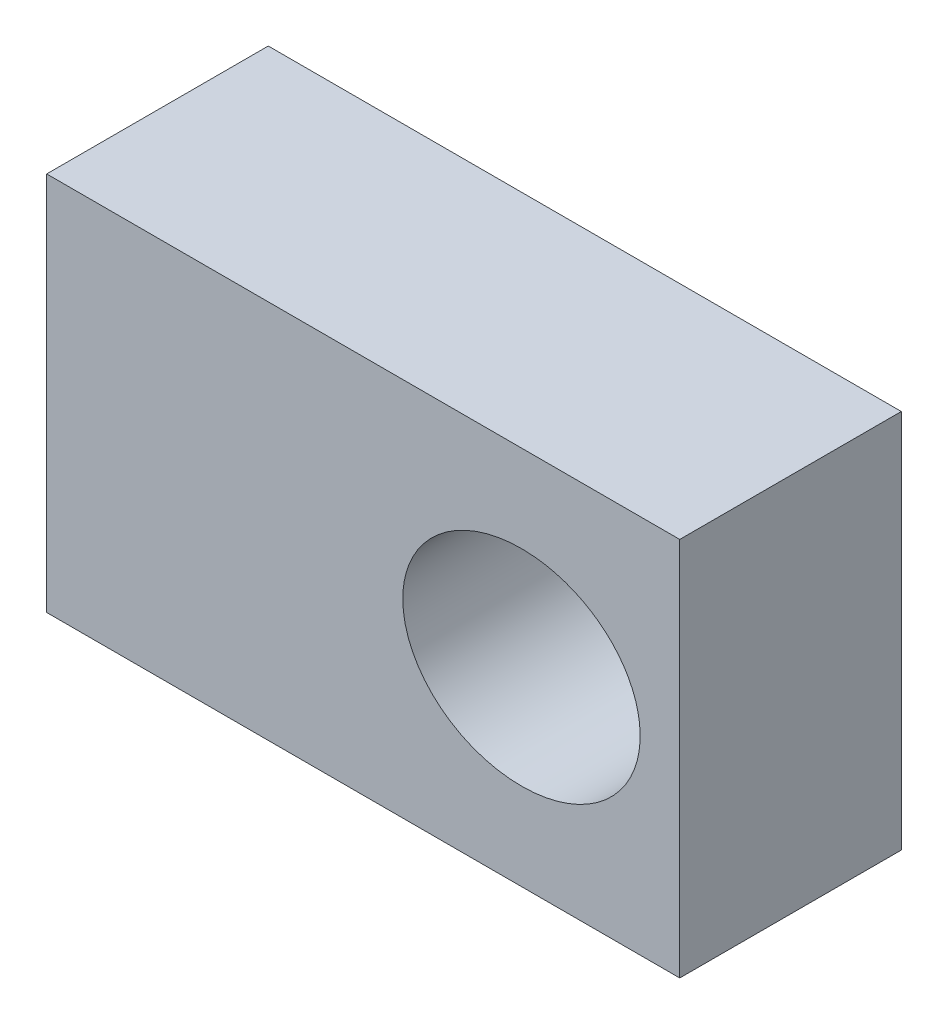
ISO-10303-21;
HEADER;
FILE_DESCRIPTION(('STEP AP214'),'2;1');
FILE_NAME('part.step','',(''),(''),'','','');
FILE_SCHEMA(('AUTOMOTIVE_DESIGN { 1 0 10303 214 1 1 1 1 }'));
ENDSEC;
DATA;
#1=APPLICATION_CONTEXT('core data for automotive mechanical design processes');
#2=APPLICATION_PROTOCOL_DEFINITION('international standard','automotive_design',2000,#1);
#3=PRODUCT_CONTEXT('',#1,'mechanical');
#4=PRODUCT('Part','Part','',(#3));
#5=PRODUCT_RELATED_PRODUCT_CATEGORY('part','',(#4));
#6=PRODUCT_DEFINITION_FORMATION('','',#4);
#7=PRODUCT_DEFINITION_CONTEXT('part definition',#1,'design');
#8=PRODUCT_DEFINITION('design','',#6,#7);
#9=PRODUCT_DEFINITION_SHAPE('','',#8);
#10=(LENGTH_UNIT() NAMED_UNIT(*) SI_UNIT(.MILLI.,.METRE.));
#11=(NAMED_UNIT(*) PLANE_ANGLE_UNIT() SI_UNIT($,.RADIAN.));
#12=(NAMED_UNIT(*) SI_UNIT($,.STERADIAN.) SOLID_ANGLE_UNIT());
#13=UNCERTAINTY_MEASURE_WITH_UNIT(LENGTH_MEASURE(1.E-05),#10,'distance_accuracy_value','');
#14=(GEOMETRIC_REPRESENTATION_CONTEXT(3) GLOBAL_UNCERTAINTY_ASSIGNED_CONTEXT((#13)) GLOBAL_UNIT_ASSIGNED_CONTEXT((#10,
#11,#12)) REPRESENTATION_CONTEXT('',''));
#15=CARTESIAN_POINT('',(0.,0.,0.));
#16=DIRECTION('',(0.,0.,1.));
#17=DIRECTION('',(1.,0.,0.));
#18=AXIS2_PLACEMENT_3D('',#15,#16,#17);
#19=CARTESIAN_POINT('',(0.,0.,70.));
#20=DIRECTION('',(0.,0.,1.));
#21=DIRECTION('',(1.,0.,0.));
#22=AXIS2_PLACEMENT_3D('',#19,#20,#21);
#23=PLANE('',#22);
#24=DIRECTION('',(0.,-1.,0.));
#25=VECTOR('',#24,1.);
#26=CARTESIAN_POINT('',(-150.,60.,70.));
#27=LINE('',#26,#25);
#28=CARTESIAN_POINT('',(-150.,60.,70.));
#29=VERTEX_POINT('',#28);
#30=CARTESIAN_POINT('',(-150.,-60.,70.));
#31=VERTEX_POINT('',#30);
#32=EDGE_CURVE('E92',#29,#31,#27,.T.);
#33=ORIENTED_EDGE('',*,*,#32,.T.);
#34=DIRECTION('',(1.,0.,0.));
#35=VECTOR('',#34,1.);
#36=CARTESIAN_POINT('',(-150.,-60.,70.));
#37=LINE('',#36,#35);
#38=CARTESIAN_POINT('',(50.,-60.,70.));
#39=VERTEX_POINT('',#38);
#40=EDGE_CURVE('E87',#31,#39,#37,.T.);
#41=ORIENTED_EDGE('',*,*,#40,.T.);
#42=DIRECTION('',(0.,1.,0.));
#43=VECTOR('',#42,1.);
#44=CARTESIAN_POINT('',(50.,60.,70.));
#45=LINE('',#44,#43);
#46=CARTESIAN_POINT('',(50.,60.,70.));
#47=VERTEX_POINT('',#46);
#48=EDGE_CURVE('E90',#39,#47,#45,.T.);
#49=ORIENTED_EDGE('',*,*,#48,.T.);
#50=DIRECTION('',(-1.,0.,0.));
#51=VECTOR('',#50,1.);
#52=CARTESIAN_POINT('',(-150.,60.,70.));
#53=LINE('',#52,#51);
#54=EDGE_CURVE('E57',#47,#29,#53,.T.);
#55=ORIENTED_EDGE('',*,*,#54,.T.);
#56=EDGE_LOOP('',(#33,#41,#49,#55));
#57=FACE_BOUND('',#56,.T.);
#58=CARTESIAN_POINT('',(0.,0.,70.));
#59=DIRECTION('',(0.,0.,1.));
#60=DIRECTION('',(-1.,0.,0.));
#61=AXIS2_PLACEMENT_3D('',#58,#59,#60);
#62=ELLIPSE('',#61,37.5,32.5);
#63=CARTESIAN_POINT('',(-37.5,0.,70.));
#64=VERTEX_POINT('',#63);
#65=EDGE_CURVE('E107',#64,#64,#62,.T.);
#66=ORIENTED_EDGE('',*,*,#65,.F.);
#67=EDGE_LOOP('',(#66));
#68=FACE_BOUND('',#67,.T.);
#69=ADVANCED_FACE('F40',(#57,#68),#23,.T.);
#70=CARTESIAN_POINT('',(0.,0.,0.));
#71=DIRECTION('',(0.,0.,1.));
#72=DIRECTION('',(1.,0.,0.));
#73=AXIS2_PLACEMENT_3D('',#70,#71,#72);
#74=PLANE('',#73);
#75=DIRECTION('',(0.,-1.,0.));
#76=VECTOR('',#75,1.);
#77=CARTESIAN_POINT('',(-150.,60.,0.));
#78=LINE('',#77,#76);
#79=CARTESIAN_POINT('',(-150.,60.,0.));
#80=VERTEX_POINT('',#79);
#81=CARTESIAN_POINT('',(-150.,-60.,0.));
#82=VERTEX_POINT('',#81);
#83=EDGE_CURVE('E104',#80,#82,#78,.T.);
#84=ORIENTED_EDGE('',*,*,#83,.F.);
#85=DIRECTION('',(-1.,0.,0.));
#86=VECTOR('',#85,1.);
#87=CARTESIAN_POINT('',(-150.,60.,0.));
#88=LINE('',#87,#86);
#89=CARTESIAN_POINT('',(50.,60.,0.));
#90=VERTEX_POINT('',#89);
#91=EDGE_CURVE('E80',#90,#80,#88,.T.);
#92=ORIENTED_EDGE('',*,*,#91,.F.);
#93=DIRECTION('',(0.,1.,0.));
#94=VECTOR('',#93,1.);
#95=CARTESIAN_POINT('',(50.,60.,0.));
#96=LINE('',#95,#94);
#97=CARTESIAN_POINT('',(50.,-60.,0.));
#98=VERTEX_POINT('',#97);
#99=EDGE_CURVE('E74',#98,#90,#96,.T.);
#100=ORIENTED_EDGE('',*,*,#99,.F.);
#101=DIRECTION('',(1.,0.,0.));
#102=VECTOR('',#101,1.);
#103=CARTESIAN_POINT('',(-150.,-60.,0.));
#104=LINE('',#103,#102);
#105=EDGE_CURVE('E96',#82,#98,#104,.T.);
#106=ORIENTED_EDGE('',*,*,#105,.F.);
#107=EDGE_LOOP('',(#84,#92,#100,#106));
#108=FACE_BOUND('',#107,.T.);
#109=CARTESIAN_POINT('',(0.,0.,0.));
#110=DIRECTION('',(0.,0.,1.));
#111=DIRECTION('',(-1.,0.,0.));
#112=AXIS2_PLACEMENT_3D('',#109,#110,#111);
#113=ELLIPSE('',#112,37.5,32.5);
#114=CARTESIAN_POINT('',(-37.5,0.,0.));
#115=VERTEX_POINT('',#114);
#116=EDGE_CURVE('E119',#115,#115,#113,.T.);
#117=ORIENTED_EDGE('',*,*,#116,.T.);
#118=EDGE_LOOP('',(#117));
#119=FACE_BOUND('',#118,.T.);
#120=ADVANCED_FACE('F115',(#108,#119),#74,.F.);
#121=CARTESIAN_POINT('',(-150.,60.,70.));
#122=DIRECTION('',(1.,0.,0.));
#123=DIRECTION('',(0.,0.,-1.));
#124=AXIS2_PLACEMENT_3D('',#121,#122,#123);
#125=PLANE('',#124);
#126=ORIENTED_EDGE('',*,*,#83,.T.);
#127=DIRECTION('',(0.,0.,-1.));
#128=VECTOR('',#127,1.);
#129=CARTESIAN_POINT('',(-150.,-60.,70.));
#130=LINE('',#129,#128);
#131=EDGE_CURVE('E11',#31,#82,#130,.T.);
#132=ORIENTED_EDGE('',*,*,#131,.F.);
#133=ORIENTED_EDGE('',*,*,#32,.F.);
#134=DIRECTION('',(0.,0.,-1.));
#135=VECTOR('',#134,1.);
#136=CARTESIAN_POINT('',(-150.,60.,70.));
#137=LINE('',#136,#135);
#138=EDGE_CURVE('E100',#29,#80,#137,.T.);
#139=ORIENTED_EDGE('',*,*,#138,.T.);
#140=EDGE_LOOP('',(#126,#132,#133,#139));
#141=FACE_BOUND('',#140,.T.);
#142=ADVANCED_FACE('F42',(#141),#125,.F.);
#143=CARTESIAN_POINT('',(-150.,-60.,70.));
#144=DIRECTION('',(0.,1.,0.));
#145=DIRECTION('',(0.,0.,1.));
#146=AXIS2_PLACEMENT_3D('',#143,#144,#145);
#147=PLANE('',#146);
#148=ORIENTED_EDGE('',*,*,#105,.T.);
#149=DIRECTION('',(0.,0.,-1.));
#150=VECTOR('',#149,1.);
#151=CARTESIAN_POINT('',(50.,-60.,70.));
#152=LINE('',#151,#150);
#153=EDGE_CURVE('E49',#39,#98,#152,.T.);
#154=ORIENTED_EDGE('',*,*,#153,.F.);
#155=ORIENTED_EDGE('',*,*,#40,.F.);
#156=ORIENTED_EDGE('',*,*,#131,.T.);
#157=EDGE_LOOP('',(#148,#154,#155,#156));
#158=FACE_BOUND('',#157,.T.);
#159=ADVANCED_FACE('F95',(#158),#147,.F.);
#160=CARTESIAN_POINT('',(50.,60.,70.));
#161=DIRECTION('',(-1.,0.,0.));
#162=DIRECTION('',(0.,0.,1.));
#163=AXIS2_PLACEMENT_3D('',#160,#161,#162);
#164=PLANE('',#163);
#165=ORIENTED_EDGE('',*,*,#99,.T.);
#166=DIRECTION('',(0.,0.,-1.));
#167=VECTOR('',#166,1.);
#168=CARTESIAN_POINT('',(50.,60.,70.));
#169=LINE('',#168,#167);
#170=EDGE_CURVE('E97',#47,#90,#169,.T.);
#171=ORIENTED_EDGE('',*,*,#170,.F.);
#172=ORIENTED_EDGE('',*,*,#48,.F.);
#173=ORIENTED_EDGE('',*,*,#153,.T.);
#174=EDGE_LOOP('',(#165,#171,#172,#173));
#175=FACE_BOUND('',#174,.T.);
#176=ADVANCED_FACE('F98',(#175),#164,.F.);
#177=CARTESIAN_POINT('',(-150.,60.,70.));
#178=DIRECTION('',(0.,-1.,0.));
#179=DIRECTION('',(0.,0.,-1.));
#180=AXIS2_PLACEMENT_3D('',#177,#178,#179);
#181=PLANE('',#180);
#182=ORIENTED_EDGE('',*,*,#91,.T.);
#183=ORIENTED_EDGE('',*,*,#138,.F.);
#184=ORIENTED_EDGE('',*,*,#54,.F.);
#185=ORIENTED_EDGE('',*,*,#170,.T.);
#186=EDGE_LOOP('',(#182,#183,#184,#185));
#187=FACE_BOUND('',#186,.T.);
#188=ADVANCED_FACE('F112',(#187),#181,.F.);
#189=DIRECTION('',(0.,0.,-1.));
#190=VECTOR('',#189,1.);
#191=SURFACE_OF_LINEAR_EXTRUSION('',#62,#190);
#192=ORIENTED_EDGE('',*,*,#65,.T.);
#193=EDGE_LOOP('',(#192));
#194=FACE_BOUND('',#193,.T.);
#195=ORIENTED_EDGE('',*,*,#116,.F.);
#196=EDGE_LOOP('',(#195));
#197=FACE_BOUND('',#196,.T.);
#198=ADVANCED_FACE('F125',(#194,#197),#191,.T.);
#199=CLOSED_SHELL('',(#69,#120,#142,#159,#176,#188,#198));
#200=MANIFOLD_SOLID_BREP('B2',#199);
#201=ADVANCED_BREP_SHAPE_REPRESENTATION('',(#18,#200),#14);
#202=SHAPE_DEFINITION_REPRESENTATION(#9,#201);
ENDSEC;
END-ISO-10303-21;
